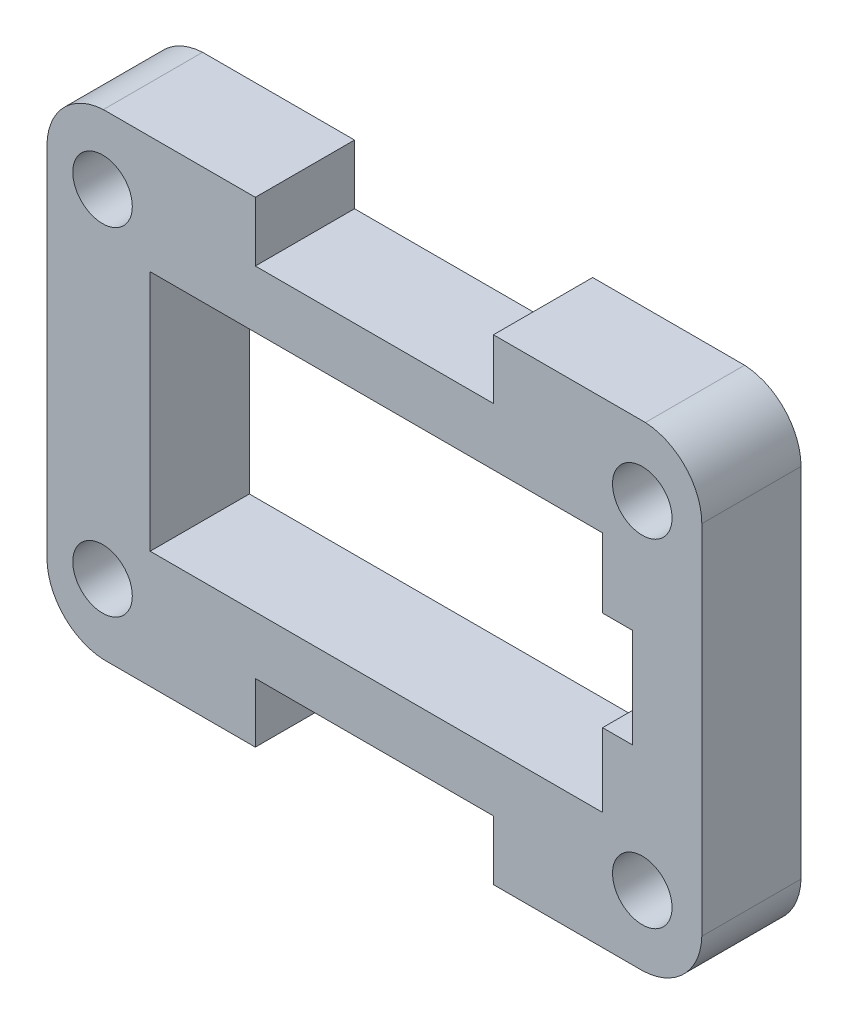
ISO-10303-21;
HEADER;
FILE_DESCRIPTION(('STEP AP214'),'2;1');
FILE_NAME('part.step','',(''),(''),'','','');
FILE_SCHEMA(('AUTOMOTIVE_DESIGN { 1 0 10303 214 1 1 1 1 }'));
ENDSEC;
DATA;
#1=APPLICATION_CONTEXT('core data for automotive mechanical design processes');
#2=APPLICATION_PROTOCOL_DEFINITION('international standard','automotive_design',2000,#1);
#3=PRODUCT_CONTEXT('',#1,'mechanical');
#4=PRODUCT('Part','Part','',(#3));
#5=PRODUCT_RELATED_PRODUCT_CATEGORY('part','',(#4));
#6=PRODUCT_DEFINITION_FORMATION('','',#4);
#7=PRODUCT_DEFINITION_CONTEXT('part definition',#1,'design');
#8=PRODUCT_DEFINITION('design','',#6,#7);
#9=PRODUCT_DEFINITION_SHAPE('','',#8);
#10=(LENGTH_UNIT() NAMED_UNIT(*) SI_UNIT(.MILLI.,.METRE.));
#11=(NAMED_UNIT(*) PLANE_ANGLE_UNIT() SI_UNIT($,.RADIAN.));
#12=(NAMED_UNIT(*) SI_UNIT($,.STERADIAN.) SOLID_ANGLE_UNIT());
#13=UNCERTAINTY_MEASURE_WITH_UNIT(LENGTH_MEASURE(1.E-05),#10,'distance_accuracy_value','');
#14=(GEOMETRIC_REPRESENTATION_CONTEXT(3) GLOBAL_UNCERTAINTY_ASSIGNED_CONTEXT((#13)) GLOBAL_UNIT_ASSIGNED_CONTEXT((#10,
#11,#12)) REPRESENTATION_CONTEXT('',''));
#15=CARTESIAN_POINT('',(0.,0.,0.));
#16=DIRECTION('',(0.,0.,1.));
#17=DIRECTION('',(1.,0.,0.));
#18=AXIS2_PLACEMENT_3D('',#15,#16,#17);
#19=CARTESIAN_POINT('',(2365.44028325265,1577.09064517226,5.));
#20=DIRECTION('',(0.,0.,1.));
#21=DIRECTION('',(1.,0.,0.));
#22=AXIS2_PLACEMENT_3D('',#19,#20,#21);
#23=PLANE('',#22);
#24=CARTESIAN_POINT('',(2338.24005814226,1559.58660497825,5.));
#25=DIRECTION('',(0.,0.,1.));
#26=DIRECTION('',(1.,0.,0.));
#27=AXIS2_PLACEMENT_3D('',#24,#25,#26);
#28=CIRCLE('',#27,1.50000000166674);
#29=CARTESIAN_POINT('',(2339.74005814393,1559.58660497825,5.));
#30=VERTEX_POINT('',#29);
#31=EDGE_CURVE('E802',#30,#30,#28,.T.);
#32=ORIENTED_EDGE('',*,*,#31,.F.);
#33=EDGE_LOOP('',(#32));
#34=FACE_BOUND('',#33,.T.);
#35=CARTESIAN_POINT('',(2365.44015813607,1576.58660498825,5.));
#36=DIRECTION('',(0.,0.,1.));
#37=DIRECTION('',(1.,0.,0.));
#38=AXIS2_PLACEMENT_3D('',#35,#36,#37);
#39=CIRCLE('',#38,1.50000000833429);
#40=CARTESIAN_POINT('',(2366.9401581444,1576.58660498825,5.));
#41=VERTEX_POINT('',#40);
#42=EDGE_CURVE('E249',#41,#41,#39,.T.);
#43=ORIENTED_EDGE('',*,*,#42,.F.);
#44=EDGE_LOOP('',(#43));
#45=FACE_BOUND('',#44,.T.);
#46=CARTESIAN_POINT('',(2365.44028325265,1577.09064517226,5.));
#47=DIRECTION('',(0.,0.,1.));
#48=DIRECTION('',(1.,0.,0.));
#49=AXIS2_PLACEMENT_3D('',#46,#47,#48);
#50=CIRCLE('',#49,2.99987488833167);
#51=CARTESIAN_POINT('',(2368.44015814071,1577.09060497992,5.));
#52=VERTEX_POINT('',#51);
#53=CARTESIAN_POINT('',(2365.59735814071,1580.08640497992,5.));
#54=VERTEX_POINT('',#53);
#55=EDGE_CURVE('E293',#52,#54,#50,.T.);
#56=ORIENTED_EDGE('',*,*,#55,.T.);
#57=DIRECTION('',(-1.,0.,0.));
#58=VECTOR('',#57,1.);
#59=CARTESIAN_POINT('',(2357.94015814059,1580.08640497992,5.));
#60=LINE('',#59,#58);
#61=CARTESIAN_POINT('',(2357.94015814059,1580.08640497992,5.));
#62=VERTEX_POINT('',#61);
#63=EDGE_CURVE('E297',#54,#62,#60,.T.);
#64=ORIENTED_EDGE('',*,*,#63,.T.);
#65=DIRECTION('',(0.,-1.,0.));
#66=VECTOR('',#65,1.);
#67=CARTESIAN_POINT('',(2357.94015814059,1577.08660497992,5.));
#68=LINE('',#67,#66);
#69=CARTESIAN_POINT('',(2357.94015814059,1577.08660497992,5.));
#70=VERTEX_POINT('',#69);
#71=EDGE_CURVE('E301',#62,#70,#68,.T.);
#72=ORIENTED_EDGE('',*,*,#71,.T.);
#73=DIRECTION('',(-1.,0.,0.));
#74=VECTOR('',#73,1.);
#75=CARTESIAN_POINT('',(2345.94015814059,1577.08660497992,5.));
#76=LINE('',#75,#74);
#77=CARTESIAN_POINT('',(2345.94015814059,1577.08660497992,5.));
#78=VERTEX_POINT('',#77);
#79=EDGE_CURVE('E304',#70,#78,#76,.T.);
#80=ORIENTED_EDGE('',*,*,#79,.T.);
#81=DIRECTION('',(0.,1.,0.));
#82=VECTOR('',#81,1.);
#83=CARTESIAN_POINT('',(2345.94015814059,1580.08640497992,5.));
#84=LINE('',#83,#82);
#85=CARTESIAN_POINT('',(2345.94015814059,1580.08640497992,5.));
#86=VERTEX_POINT('',#85);
#87=EDGE_CURVE('E307',#78,#86,#84,.T.);
#88=ORIENTED_EDGE('',*,*,#87,.T.);
#89=DIRECTION('',(-1.,1.15992584717666E-13,0.));
#90=VECTOR('',#89,1.);
#91=CARTESIAN_POINT('',(2338.28295814059,1580.08640497992,5.));
#92=LINE('',#91,#90);
#93=CARTESIAN_POINT('',(2338.28295814059,1580.08640497992,5.));
#94=VERTEX_POINT('',#93);
#95=EDGE_CURVE('E310',#86,#94,#92,.T.);
#96=ORIENTED_EDGE('',*,*,#95,.T.);
#97=CARTESIAN_POINT('',(2338.44003302866,1577.09064517226,5.));
#98=DIRECTION('',(0.,0.,1.));
#99=DIRECTION('',(1.,0.,0.));
#100=AXIS2_PLACEMENT_3D('',#97,#98,#99);
#101=CIRCLE('',#100,2.99987488833123);
#102=CARTESIAN_POINT('',(2335.4401581406,1577.09060497992,5.));
#103=VERTEX_POINT('',#102);
#104=EDGE_CURVE('E313',#94,#103,#101,.T.);
#105=ORIENTED_EDGE('',*,*,#104,.T.);
#106=DIRECTION('',(0.,-1.,0.));
#107=VECTOR('',#106,1.);
#108=CARTESIAN_POINT('',(2335.4401581406,1559.08240497992,5.));
#109=LINE('',#108,#107);
#110=CARTESIAN_POINT('',(2335.4401581406,1559.08240497992,5.));
#111=VERTEX_POINT('',#110);
#112=EDGE_CURVE('E316',#103,#111,#109,.T.);
#113=ORIENTED_EDGE('',*,*,#112,.T.);
#114=CARTESIAN_POINT('',(2338.44003302866,1559.08236478758,5.));
#115=DIRECTION('',(0.,0.,1.));
#116=DIRECTION('',(1.,0.,0.));
#117=AXIS2_PLACEMENT_3D('',#114,#115,#116);
#118=CIRCLE('',#117,2.99987488833177);
#119=CARTESIAN_POINT('',(2338.28295814059,1556.08660497992,5.));
#120=VERTEX_POINT('',#119);
#121=EDGE_CURVE('E319',#111,#120,#118,.T.);
#122=ORIENTED_EDGE('',*,*,#121,.T.);
#123=DIRECTION('',(1.,0.,0.));
#124=VECTOR('',#123,1.);
#125=CARTESIAN_POINT('',(2345.94015814059,1556.08660497992,5.));
#126=LINE('',#125,#124);
#127=CARTESIAN_POINT('',(2345.94015814059,1556.08660497992,5.));
#128=VERTEX_POINT('',#127);
#129=EDGE_CURVE('E322',#120,#128,#126,.T.);
#130=ORIENTED_EDGE('',*,*,#129,.T.);
#131=DIRECTION('',(0.,1.,0.));
#132=VECTOR('',#131,1.);
#133=CARTESIAN_POINT('',(2345.94015814059,1559.08660497992,5.));
#134=LINE('',#133,#132);
#135=CARTESIAN_POINT('',(2345.94015814059,1559.08660497992,5.));
#136=VERTEX_POINT('',#135);
#137=EDGE_CURVE('E325',#128,#136,#134,.T.);
#138=ORIENTED_EDGE('',*,*,#137,.T.);
#139=DIRECTION('',(1.,0.,0.));
#140=VECTOR('',#139,1.);
#141=CARTESIAN_POINT('',(2357.94015814059,1559.08660497992,5.));
#142=LINE('',#141,#140);
#143=CARTESIAN_POINT('',(2357.94015814059,1559.08660497992,5.));
#144=VERTEX_POINT('',#143);
#145=EDGE_CURVE('E328',#136,#144,#142,.T.);
#146=ORIENTED_EDGE('',*,*,#145,.T.);
#147=DIRECTION('',(0.,-1.,0.));
#148=VECTOR('',#147,1.);
#149=CARTESIAN_POINT('',(2357.94015814059,1556.08660497992,5.));
#150=LINE('',#149,#148);
#151=CARTESIAN_POINT('',(2357.94015814059,1556.08660497992,5.));
#152=VERTEX_POINT('',#151);
#153=EDGE_CURVE('E331',#144,#152,#150,.T.);
#154=ORIENTED_EDGE('',*,*,#153,.T.);
#155=DIRECTION('',(1.,0.,0.));
#156=VECTOR('',#155,1.);
#157=CARTESIAN_POINT('',(2365.44015814059,1556.08660497992,5.));
#158=LINE('',#157,#156);
#159=CARTESIAN_POINT('',(2365.44015814059,1556.08660497992,5.));
#160=VERTEX_POINT('',#159);
#161=EDGE_CURVE('E334',#152,#160,#158,.T.);
#162=ORIENTED_EDGE('',*,*,#161,.T.);
#163=CARTESIAN_POINT('',(2365.36168325253,1559.16519283098,5.));
#164=DIRECTION('',(0.,0.,1.));
#165=DIRECTION('',(1.,0.,0.));
#166=AXIS2_PLACEMENT_3D('',#163,#164,#165);
#167=CIRCLE('',#166,3.07958787254719);
#168=CARTESIAN_POINT('',(2368.44015814059,1559.08240497992,5.));
#169=VERTEX_POINT('',#168);
#170=EDGE_CURVE('E337',#160,#169,#167,.T.);
#171=ORIENTED_EDGE('',*,*,#170,.T.);
#172=DIRECTION('',(6.41170103403003E-12,1.,0.));
#173=VECTOR('',#172,1.);
#174=CARTESIAN_POINT('',(2368.44015814071,1577.09060497992,5.));
#175=LINE('',#174,#173);
#176=EDGE_CURVE('E340',#169,#52,#175,.T.);
#177=ORIENTED_EDGE('',*,*,#176,.T.);
#178=EDGE_LOOP('',(#56,#64,#72,#80,#88,#96,#105,#113,#122,#130,#138,#146,#154,#162,#171,#177));
#179=FACE_BOUND('',#178,.T.);
#180=DIRECTION('',(-1.,0.,0.));
#181=VECTOR('',#180,1.);
#182=CARTESIAN_POINT('',(2340.64015814059,1574.18860498835,5.));
#183=LINE('',#182,#181);
#184=CARTESIAN_POINT('',(2363.44015814059,1574.18860498835,5.));
#185=VERTEX_POINT('',#184);
#186=CARTESIAN_POINT('',(2340.64015814059,1574.18860498835,5.));
#187=VERTEX_POINT('',#186);
#188=EDGE_CURVE('E210',#185,#187,#183,.T.);
#189=ORIENTED_EDGE('',*,*,#188,.F.);
#190=DIRECTION('',(0.,1.,0.));
#191=VECTOR('',#190,1.);
#192=CARTESIAN_POINT('',(2363.44015814059,1574.18860498835,5.));
#193=LINE('',#192,#191);
#194=CARTESIAN_POINT('',(2363.44015814059,1570.68860498835,5.));
#195=VERTEX_POINT('',#194);
#196=EDGE_CURVE('E201',#195,#185,#193,.T.);
#197=ORIENTED_EDGE('',*,*,#196,.F.);
#198=DIRECTION('',(-1.,0.,0.));
#199=VECTOR('',#198,1.);
#200=CARTESIAN_POINT('',(2363.44015814059,1570.68860498835,5.));
#201=LINE('',#200,#199);
#202=CARTESIAN_POINT('',(2364.94015814059,1570.68860498835,5.));
#203=VERTEX_POINT('',#202);
#204=EDGE_CURVE('E244',#203,#195,#201,.T.);
#205=ORIENTED_EDGE('',*,*,#204,.F.);
#206=DIRECTION('',(0.,1.,0.));
#207=VECTOR('',#206,1.);
#208=CARTESIAN_POINT('',(2364.94015814059,1570.68860498835,5.));
#209=LINE('',#208,#207);
#210=CARTESIAN_POINT('',(2364.94015814059,1565.68860498835,5.));
#211=VERTEX_POINT('',#210);
#212=EDGE_CURVE('E241',#211,#203,#209,.T.);
#213=ORIENTED_EDGE('',*,*,#212,.F.);
#214=DIRECTION('',(1.,0.,0.));
#215=VECTOR('',#214,1.);
#216=CARTESIAN_POINT('',(2364.94015814059,1565.68860498835,5.));
#217=LINE('',#216,#215);
#218=CARTESIAN_POINT('',(2363.44015814059,1565.68860498835,5.));
#219=VERTEX_POINT('',#218);
#220=EDGE_CURVE('E238',#219,#211,#217,.T.);
#221=ORIENTED_EDGE('',*,*,#220,.F.);
#222=DIRECTION('',(0.,1.,0.));
#223=VECTOR('',#222,1.);
#224=CARTESIAN_POINT('',(2363.44015814059,1565.68860498835,5.));
#225=LINE('',#224,#223);
#226=CARTESIAN_POINT('',(2363.44015814059,1561.98860498835,5.));
#227=VERTEX_POINT('',#226);
#228=EDGE_CURVE('E235',#227,#219,#225,.T.);
#229=ORIENTED_EDGE('',*,*,#228,.F.);
#230=DIRECTION('',(1.,0.,0.));
#231=VECTOR('',#230,1.);
#232=CARTESIAN_POINT('',(2363.44015814059,1561.98860498835,5.));
#233=LINE('',#232,#231);
#234=CARTESIAN_POINT('',(2340.64015814059,1561.98860498835,5.));
#235=VERTEX_POINT('',#234);
#236=EDGE_CURVE('E229',#235,#227,#233,.T.);
#237=ORIENTED_EDGE('',*,*,#236,.F.);
#238=DIRECTION('',(0.,-1.,0.));
#239=VECTOR('',#238,1.);
#240=CARTESIAN_POINT('',(2340.64015814059,1561.98860498835,5.));
#241=LINE('',#240,#239);
#242=EDGE_CURVE('E225',#187,#235,#241,.T.);
#243=ORIENTED_EDGE('',*,*,#242,.F.);
#244=EDGE_LOOP('',(#189,#197,#205,#213,#221,#229,#237,#243));
#245=FACE_BOUND('',#244,.T.);
#246=CARTESIAN_POINT('',(2365.44010814393,1559.58655498325,5.));
#247=DIRECTION('',(0.,0.,1.));
#248=DIRECTION('',(1.,0.,0.));
#249=AXIS2_PLACEMENT_3D('',#246,#247,#248);
#250=CIRCLE('',#249,1.50000000000011);
#251=CARTESIAN_POINT('',(2366.94010814393,1559.58655498325,5.));
#252=VERTEX_POINT('',#251);
#253=EDGE_CURVE('E810',#252,#252,#250,.T.);
#254=ORIENTED_EDGE('',*,*,#253,.F.);
#255=EDGE_LOOP('',(#254));
#256=FACE_BOUND('',#255,.T.);
#257=CARTESIAN_POINT('',(2338.24010813393,1576.58665499325,5.));
#258=DIRECTION('',(0.,0.,1.));
#259=DIRECTION('',(1.,0.,0.));
#260=AXIS2_PLACEMENT_3D('',#257,#258,#259);
#261=CIRCLE('',#260,1.50000000000011);
#262=CARTESIAN_POINT('',(2339.74010813393,1576.58665499325,5.));
#263=VERTEX_POINT('',#262);
#264=EDGE_CURVE('E791',#263,#263,#261,.T.);
#265=ORIENTED_EDGE('',*,*,#264,.F.);
#266=EDGE_LOOP('',(#265));
#267=FACE_BOUND('',#266,.T.);
#268=ADVANCED_FACE('F39',(#34,#45,#179,#245,#256,#267),#23,.T.);
#269=CARTESIAN_POINT('',(2365.44028325265,1577.09064517226,0.));
#270=DIRECTION('',(0.,0.,1.));
#271=DIRECTION('',(1.,0.,0.));
#272=AXIS2_PLACEMENT_3D('',#269,#270,#271);
#273=PLANE('',#272);
#274=CARTESIAN_POINT('',(2365.44028325265,1577.09064517226,0.));
#275=DIRECTION('',(0.,0.,1.));
#276=DIRECTION('',(1.,0.,0.));
#277=AXIS2_PLACEMENT_3D('',#274,#275,#276);
#278=CIRCLE('',#277,2.99987488833167);
#279=CARTESIAN_POINT('',(2368.44015814071,1577.09060497992,0.));
#280=VERTEX_POINT('',#279);
#281=CARTESIAN_POINT('',(2365.59735814071,1580.08640497992,0.));
#282=VERTEX_POINT('',#281);
#283=EDGE_CURVE('E219',#280,#282,#278,.T.);
#284=ORIENTED_EDGE('',*,*,#283,.F.);
#285=DIRECTION('',(6.41170103403003E-12,1.,0.));
#286=VECTOR('',#285,1.);
#287=CARTESIAN_POINT('',(2368.44015814071,1577.09060497992,0.));
#288=LINE('',#287,#286);
#289=CARTESIAN_POINT('',(2368.44015814059,1559.08240497992,0.));
#290=VERTEX_POINT('',#289);
#291=EDGE_CURVE('E298',#290,#280,#288,.T.);
#292=ORIENTED_EDGE('',*,*,#291,.F.);
#293=CARTESIAN_POINT('',(2365.36168325253,1559.16519283098,0.));
#294=DIRECTION('',(0.,0.,1.));
#295=DIRECTION('',(1.,0.,0.));
#296=AXIS2_PLACEMENT_3D('',#293,#294,#295);
#297=CIRCLE('',#296,3.07958787254719);
#298=CARTESIAN_POINT('',(2365.44015814059,1556.08660497992,0.));
#299=VERTEX_POINT('',#298);
#300=EDGE_CURVE('E386',#299,#290,#297,.T.);
#301=ORIENTED_EDGE('',*,*,#300,.F.);
#302=DIRECTION('',(1.,0.,0.));
#303=VECTOR('',#302,1.);
#304=CARTESIAN_POINT('',(2365.44015814059,1556.08660497992,0.));
#305=LINE('',#304,#303);
#306=CARTESIAN_POINT('',(2357.94015814059,1556.08660497992,0.));
#307=VERTEX_POINT('',#306);
#308=EDGE_CURVE('E383',#307,#299,#305,.T.);
#309=ORIENTED_EDGE('',*,*,#308,.F.);
#310=DIRECTION('',(0.,-1.,0.));
#311=VECTOR('',#310,1.);
#312=CARTESIAN_POINT('',(2357.94015814059,1556.08660497992,0.));
#313=LINE('',#312,#311);
#314=CARTESIAN_POINT('',(2357.94015814059,1559.08660497992,0.));
#315=VERTEX_POINT('',#314);
#316=EDGE_CURVE('E380',#315,#307,#313,.T.);
#317=ORIENTED_EDGE('',*,*,#316,.F.);
#318=DIRECTION('',(1.,0.,0.));
#319=VECTOR('',#318,1.);
#320=CARTESIAN_POINT('',(2357.94015814059,1559.08660497992,0.));
#321=LINE('',#320,#319);
#322=CARTESIAN_POINT('',(2345.94015814059,1559.08660497992,0.));
#323=VERTEX_POINT('',#322);
#324=EDGE_CURVE('E377',#323,#315,#321,.T.);
#325=ORIENTED_EDGE('',*,*,#324,.F.);
#326=DIRECTION('',(0.,1.,0.));
#327=VECTOR('',#326,1.);
#328=CARTESIAN_POINT('',(2345.94015814059,1559.08660497992,0.));
#329=LINE('',#328,#327);
#330=CARTESIAN_POINT('',(2345.94015814059,1556.08660497992,0.));
#331=VERTEX_POINT('',#330);
#332=EDGE_CURVE('E374',#331,#323,#329,.T.);
#333=ORIENTED_EDGE('',*,*,#332,.F.);
#334=DIRECTION('',(1.,0.,0.));
#335=VECTOR('',#334,1.);
#336=CARTESIAN_POINT('',(2345.94015814059,1556.08660497992,0.));
#337=LINE('',#336,#335);
#338=CARTESIAN_POINT('',(2338.28295814059,1556.08660497992,0.));
#339=VERTEX_POINT('',#338);
#340=EDGE_CURVE('E371',#339,#331,#337,.T.);
#341=ORIENTED_EDGE('',*,*,#340,.F.);
#342=CARTESIAN_POINT('',(2338.44003302866,1559.08236478758,0.));
#343=DIRECTION('',(0.,0.,1.));
#344=DIRECTION('',(1.,0.,0.));
#345=AXIS2_PLACEMENT_3D('',#342,#343,#344);
#346=CIRCLE('',#345,2.99987488833177);
#347=CARTESIAN_POINT('',(2335.4401581406,1559.08240497992,0.));
#348=VERTEX_POINT('',#347);
#349=EDGE_CURVE('E368',#348,#339,#346,.T.);
#350=ORIENTED_EDGE('',*,*,#349,.F.);
#351=DIRECTION('',(0.,-1.,0.));
#352=VECTOR('',#351,1.);
#353=CARTESIAN_POINT('',(2335.4401581406,1559.08240497992,0.));
#354=LINE('',#353,#352);
#355=CARTESIAN_POINT('',(2335.4401581406,1577.09060497992,0.));
#356=VERTEX_POINT('',#355);
#357=EDGE_CURVE('E365',#356,#348,#354,.T.);
#358=ORIENTED_EDGE('',*,*,#357,.F.);
#359=CARTESIAN_POINT('',(2338.44003302866,1577.09064517226,0.));
#360=DIRECTION('',(0.,0.,1.));
#361=DIRECTION('',(1.,0.,0.));
#362=AXIS2_PLACEMENT_3D('',#359,#360,#361);
#363=CIRCLE('',#362,2.99987488833123);
#364=CARTESIAN_POINT('',(2338.28295814059,1580.08640497992,0.));
#365=VERTEX_POINT('',#364);
#366=EDGE_CURVE('E362',#365,#356,#363,.T.);
#367=ORIENTED_EDGE('',*,*,#366,.F.);
#368=DIRECTION('',(-1.,1.15992584717666E-13,0.));
#369=VECTOR('',#368,1.);
#370=CARTESIAN_POINT('',(2338.28295814059,1580.08640497992,0.));
#371=LINE('',#370,#369);
#372=CARTESIAN_POINT('',(2345.94015814059,1580.08640497992,0.));
#373=VERTEX_POINT('',#372);
#374=EDGE_CURVE('E359',#373,#365,#371,.T.);
#375=ORIENTED_EDGE('',*,*,#374,.F.);
#376=DIRECTION('',(0.,1.,0.));
#377=VECTOR('',#376,1.);
#378=CARTESIAN_POINT('',(2345.94015814059,1580.08640497992,0.));
#379=LINE('',#378,#377);
#380=CARTESIAN_POINT('',(2345.94015814059,1577.08660497992,0.));
#381=VERTEX_POINT('',#380);
#382=EDGE_CURVE('E356',#381,#373,#379,.T.);
#383=ORIENTED_EDGE('',*,*,#382,.F.);
#384=DIRECTION('',(-1.,0.,0.));
#385=VECTOR('',#384,1.);
#386=CARTESIAN_POINT('',(2345.94015814059,1577.08660497992,0.));
#387=LINE('',#386,#385);
#388=CARTESIAN_POINT('',(2357.94015814059,1577.08660497992,0.));
#389=VERTEX_POINT('',#388);
#390=EDGE_CURVE('E353',#389,#381,#387,.T.);
#391=ORIENTED_EDGE('',*,*,#390,.F.);
#392=DIRECTION('',(0.,-1.,0.));
#393=VECTOR('',#392,1.);
#394=CARTESIAN_POINT('',(2357.94015814059,1577.08660497992,0.));
#395=LINE('',#394,#393);
#396=CARTESIAN_POINT('',(2357.94015814059,1580.08640497992,0.));
#397=VERTEX_POINT('',#396);
#398=EDGE_CURVE('E350',#397,#389,#395,.T.);
#399=ORIENTED_EDGE('',*,*,#398,.F.);
#400=DIRECTION('',(-1.,0.,0.));
#401=VECTOR('',#400,1.);
#402=CARTESIAN_POINT('',(2357.94015814059,1580.08640497992,0.));
#403=LINE('',#402,#401);
#404=EDGE_CURVE('E347',#282,#397,#403,.T.);
#405=ORIENTED_EDGE('',*,*,#404,.F.);
#406=EDGE_LOOP('',(#284,#292,#301,#309,#317,#325,#333,#341,#350,#358,#367,#375,#383,#391,#399,#405));
#407=FACE_BOUND('',#406,.T.);
#408=DIRECTION('',(0.,1.,0.));
#409=VECTOR('',#408,1.);
#410=CARTESIAN_POINT('',(2363.44015814059,1574.18860498835,0.));
#411=LINE('',#410,#409);
#412=CARTESIAN_POINT('',(2363.44015814059,1570.68860498835,0.));
#413=VERTEX_POINT('',#412);
#414=CARTESIAN_POINT('',(2363.44015814059,1574.18860498835,0.));
#415=VERTEX_POINT('',#414);
#416=EDGE_CURVE('E63',#413,#415,#411,.T.);
#417=ORIENTED_EDGE('',*,*,#416,.T.);
#418=DIRECTION('',(-1.,0.,0.));
#419=VECTOR('',#418,1.);
#420=CARTESIAN_POINT('',(2340.64015814059,1574.18860498835,0.));
#421=LINE('',#420,#419);
#422=CARTESIAN_POINT('',(2340.64015814059,1574.18860498835,0.));
#423=VERTEX_POINT('',#422);
#424=EDGE_CURVE('E217',#415,#423,#421,.T.);
#425=ORIENTED_EDGE('',*,*,#424,.T.);
#426=DIRECTION('',(0.,-1.,0.));
#427=VECTOR('',#426,1.);
#428=CARTESIAN_POINT('',(2340.64015814059,1561.98860498835,0.));
#429=LINE('',#428,#427);
#430=CARTESIAN_POINT('',(2340.64015814059,1561.98860498835,0.));
#431=VERTEX_POINT('',#430);
#432=EDGE_CURVE('E252',#423,#431,#429,.T.);
#433=ORIENTED_EDGE('',*,*,#432,.T.);
#434=DIRECTION('',(1.,0.,0.));
#435=VECTOR('',#434,1.);
#436=CARTESIAN_POINT('',(2363.44015814059,1561.98860498835,0.));
#437=LINE('',#436,#435);
#438=CARTESIAN_POINT('',(2363.44015814059,1561.98860498835,0.));
#439=VERTEX_POINT('',#438);
#440=EDGE_CURVE('E256',#431,#439,#437,.T.);
#441=ORIENTED_EDGE('',*,*,#440,.T.);
#442=DIRECTION('',(0.,1.,0.));
#443=VECTOR('',#442,1.);
#444=CARTESIAN_POINT('',(2363.44015814059,1565.68860498835,0.));
#445=LINE('',#444,#443);
#446=CARTESIAN_POINT('',(2363.44015814059,1565.68860498835,0.));
#447=VERTEX_POINT('',#446);
#448=EDGE_CURVE('E260',#439,#447,#445,.T.);
#449=ORIENTED_EDGE('',*,*,#448,.T.);
#450=DIRECTION('',(1.,0.,0.));
#451=VECTOR('',#450,1.);
#452=CARTESIAN_POINT('',(2364.94015814059,1565.68860498835,0.));
#453=LINE('',#452,#451);
#454=CARTESIAN_POINT('',(2364.94015814059,1565.68860498835,0.));
#455=VERTEX_POINT('',#454);
#456=EDGE_CURVE('E264',#447,#455,#453,.T.);
#457=ORIENTED_EDGE('',*,*,#456,.T.);
#458=DIRECTION('',(0.,1.,0.));
#459=VECTOR('',#458,1.);
#460=CARTESIAN_POINT('',(2364.94015814059,1570.68860498835,0.));
#461=LINE('',#460,#459);
#462=CARTESIAN_POINT('',(2364.94015814059,1570.68860498835,0.));
#463=VERTEX_POINT('',#462);
#464=EDGE_CURVE('E268',#455,#463,#461,.T.);
#465=ORIENTED_EDGE('',*,*,#464,.T.);
#466=DIRECTION('',(-1.,0.,0.));
#467=VECTOR('',#466,1.);
#468=CARTESIAN_POINT('',(2363.44015814059,1570.68860498835,0.));
#469=LINE('',#468,#467);
#470=EDGE_CURVE('E211',#463,#413,#469,.T.);
#471=ORIENTED_EDGE('',*,*,#470,.T.);
#472=EDGE_LOOP('',(#417,#425,#433,#441,#449,#457,#465,#471));
#473=FACE_BOUND('',#472,.T.);
#474=CARTESIAN_POINT('',(2365.44015813607,1576.58660498825,0.));
#475=DIRECTION('',(0.,0.,1.));
#476=DIRECTION('',(1.,0.,0.));
#477=AXIS2_PLACEMENT_3D('',#474,#475,#476);
#478=CIRCLE('',#477,1.50000000833429);
#479=CARTESIAN_POINT('',(2366.9401581444,1576.58660498825,0.));
#480=VERTEX_POINT('',#479);
#481=EDGE_CURVE('E814',#480,#480,#478,.T.);
#482=ORIENTED_EDGE('',*,*,#481,.T.);
#483=EDGE_LOOP('',(#482));
#484=FACE_BOUND('',#483,.T.);
#485=CARTESIAN_POINT('',(2365.44010814393,1559.58655498325,0.));
#486=DIRECTION('',(0.,0.,1.));
#487=DIRECTION('',(1.,0.,0.));
#488=AXIS2_PLACEMENT_3D('',#485,#486,#487);
#489=CIRCLE('',#488,1.50000000000011);
#490=CARTESIAN_POINT('',(2366.94010814393,1559.58655498325,0.));
#491=VERTEX_POINT('',#490);
#492=EDGE_CURVE('E806',#491,#491,#489,.T.);
#493=ORIENTED_EDGE('',*,*,#492,.T.);
#494=EDGE_LOOP('',(#493));
#495=FACE_BOUND('',#494,.T.);
#496=CARTESIAN_POINT('',(2338.24005814226,1559.58660497825,0.));
#497=DIRECTION('',(0.,0.,1.));
#498=DIRECTION('',(1.,0.,0.));
#499=AXIS2_PLACEMENT_3D('',#496,#497,#498);
#500=CIRCLE('',#499,1.50000000166674);
#501=CARTESIAN_POINT('',(2339.74005814393,1559.58660497825,0.));
#502=VERTEX_POINT('',#501);
#503=EDGE_CURVE('E799',#502,#502,#500,.T.);
#504=ORIENTED_EDGE('',*,*,#503,.T.);
#505=EDGE_LOOP('',(#504));
#506=FACE_BOUND('',#505,.T.);
#507=CARTESIAN_POINT('',(2338.24010813393,1576.58665499325,0.));
#508=DIRECTION('',(0.,0.,1.));
#509=DIRECTION('',(1.,0.,0.));
#510=AXIS2_PLACEMENT_3D('',#507,#508,#509);
#511=CIRCLE('',#510,1.50000000000011);
#512=CARTESIAN_POINT('',(2339.74010813393,1576.58665499325,0.));
#513=VERTEX_POINT('',#512);
#514=EDGE_CURVE('E794',#513,#513,#511,.T.);
#515=ORIENTED_EDGE('',*,*,#514,.T.);
#516=EDGE_LOOP('',(#515));
#517=FACE_BOUND('',#516,.T.);
#518=ADVANCED_FACE('F457',(#407,#473,#484,#495,#506,#517),#273,.F.);
#519=CARTESIAN_POINT('',(2365.44028325265,1577.09064517226,5.));
#520=DIRECTION('',(0.,0.,-1.));
#521=DIRECTION('',(-1.,0.,0.));
#522=AXIS2_PLACEMENT_3D('',#519,#520,#521);
#523=CYLINDRICAL_SURFACE('',#522,2.99987488833167);
#524=ORIENTED_EDGE('',*,*,#283,.T.);
#525=DIRECTION('',(0.,0.,-1.));
#526=VECTOR('',#525,1.);
#527=CARTESIAN_POINT('',(2365.59735814071,1580.08640497992,5.));
#528=LINE('',#527,#526);
#529=EDGE_CURVE('E11',#54,#282,#528,.T.);
#530=ORIENTED_EDGE('',*,*,#529,.F.);
#531=ORIENTED_EDGE('',*,*,#55,.F.);
#532=DIRECTION('',(0.,0.,-1.));
#533=VECTOR('',#532,1.);
#534=CARTESIAN_POINT('',(2368.44015814071,1577.09060497992,5.));
#535=LINE('',#534,#533);
#536=EDGE_CURVE('E343',#52,#280,#535,.T.);
#537=ORIENTED_EDGE('',*,*,#536,.T.);
#538=EDGE_LOOP('',(#524,#530,#531,#537));
#539=FACE_BOUND('',#538,.T.);
#540=ADVANCED_FACE('F41',(#539),#523,.T.);
#541=CARTESIAN_POINT('',(2357.94015814059,1580.08640497992,5.));
#542=DIRECTION('',(0.,-1.,0.));
#543=DIRECTION('',(1.,0.,0.));
#544=AXIS2_PLACEMENT_3D('',#541,#542,#543);
#545=PLANE('',#544);
#546=ORIENTED_EDGE('',*,*,#404,.T.);
#547=DIRECTION('',(0.,0.,-1.));
#548=VECTOR('',#547,1.);
#549=CARTESIAN_POINT('',(2357.94015814059,1580.08640497992,5.));
#550=LINE('',#549,#548);
#551=EDGE_CURVE('E48',#62,#397,#550,.T.);
#552=ORIENTED_EDGE('',*,*,#551,.F.);
#553=ORIENTED_EDGE('',*,*,#63,.F.);
#554=ORIENTED_EDGE('',*,*,#529,.T.);
#555=EDGE_LOOP('',(#546,#552,#553,#554));
#556=FACE_BOUND('',#555,.T.);
#557=ADVANCED_FACE('F474',(#556),#545,.F.);
#558=CARTESIAN_POINT('',(2357.94015814059,1577.08660497992,5.));
#559=DIRECTION('',(1.,0.,0.));
#560=DIRECTION('',(0.,0.,-1.));
#561=AXIS2_PLACEMENT_3D('',#558,#559,#560);
#562=PLANE('',#561);
#563=ORIENTED_EDGE('',*,*,#398,.T.);
#564=DIRECTION('',(0.,0.,-1.));
#565=VECTOR('',#564,1.);
#566=CARTESIAN_POINT('',(2357.94015814059,1577.08660497992,5.));
#567=LINE('',#566,#565);
#568=EDGE_CURVE('E442',#70,#389,#567,.T.);
#569=ORIENTED_EDGE('',*,*,#568,.F.);
#570=ORIENTED_EDGE('',*,*,#71,.F.);
#571=ORIENTED_EDGE('',*,*,#551,.T.);
#572=EDGE_LOOP('',(#563,#569,#570,#571));
#573=FACE_BOUND('',#572,.T.);
#574=ADVANCED_FACE('F451',(#573),#562,.F.);
#575=CARTESIAN_POINT('',(2345.94015814059,1577.08660497992,5.));
#576=DIRECTION('',(0.,-1.,0.));
#577=DIRECTION('',(0.,0.,-1.));
#578=AXIS2_PLACEMENT_3D('',#575,#576,#577);
#579=PLANE('',#578);
#580=ORIENTED_EDGE('',*,*,#390,.T.);
#581=DIRECTION('',(0.,0.,-1.));
#582=VECTOR('',#581,1.);
#583=CARTESIAN_POINT('',(2345.94015814059,1577.08660497992,5.));
#584=LINE('',#583,#582);
#585=EDGE_CURVE('E438',#78,#381,#584,.T.);
#586=ORIENTED_EDGE('',*,*,#585,.F.);
#587=ORIENTED_EDGE('',*,*,#79,.F.);
#588=ORIENTED_EDGE('',*,*,#568,.T.);
#589=EDGE_LOOP('',(#580,#586,#587,#588));
#590=FACE_BOUND('',#589,.T.);
#591=ADVANCED_FACE('F463',(#590),#579,.F.);
#592=CARTESIAN_POINT('',(2345.94015814059,1580.08640497992,5.));
#593=DIRECTION('',(-1.,0.,0.));
#594=DIRECTION('',(0.,0.,1.));
#595=AXIS2_PLACEMENT_3D('',#592,#593,#594);
#596=PLANE('',#595);
#597=ORIENTED_EDGE('',*,*,#382,.T.);
#598=DIRECTION('',(0.,0.,-1.));
#599=VECTOR('',#598,1.);
#600=CARTESIAN_POINT('',(2345.94015814059,1580.08640497992,5.));
#601=LINE('',#600,#599);
#602=EDGE_CURVE('E434',#86,#373,#601,.T.);
#603=ORIENTED_EDGE('',*,*,#602,.F.);
#604=ORIENTED_EDGE('',*,*,#87,.F.);
#605=ORIENTED_EDGE('',*,*,#585,.T.);
#606=EDGE_LOOP('',(#597,#603,#604,#605));
#607=FACE_BOUND('',#606,.T.);
#608=ADVANCED_FACE('F467',(#607),#596,.F.);
#609=CARTESIAN_POINT('',(2338.28295814059,1580.08640497992,5.));
#610=DIRECTION('',(-1.15992584717666E-13,-1.,0.));
#611=DIRECTION('',(1.,-1.15992584717666E-13,0.));
#612=AXIS2_PLACEMENT_3D('',#609,#610,#611);
#613=PLANE('',#612);
#614=ORIENTED_EDGE('',*,*,#374,.T.);
#615=DIRECTION('',(0.,0.,-1.));
#616=VECTOR('',#615,1.);
#617=CARTESIAN_POINT('',(2338.28295814059,1580.08640497992,5.));
#618=LINE('',#617,#616);
#619=EDGE_CURVE('E430',#94,#365,#618,.T.);
#620=ORIENTED_EDGE('',*,*,#619,.F.);
#621=ORIENTED_EDGE('',*,*,#95,.F.);
#622=ORIENTED_EDGE('',*,*,#602,.T.);
#623=EDGE_LOOP('',(#614,#620,#621,#622));
#624=FACE_BOUND('',#623,.T.);
#625=ADVANCED_FACE('F527',(#624),#613,.F.);
#626=CARTESIAN_POINT('',(2338.44003302866,1577.09064517226,5.));
#627=DIRECTION('',(0.,0.,-1.));
#628=DIRECTION('',(-1.,0.,0.));
#629=AXIS2_PLACEMENT_3D('',#626,#627,#628);
#630=CYLINDRICAL_SURFACE('',#629,2.99987488833123);
#631=ORIENTED_EDGE('',*,*,#366,.T.);
#632=DIRECTION('',(0.,0.,-1.));
#633=VECTOR('',#632,1.);
#634=CARTESIAN_POINT('',(2335.4401581406,1577.09060497992,5.));
#635=LINE('',#634,#633);
#636=EDGE_CURVE('E426',#103,#356,#635,.T.);
#637=ORIENTED_EDGE('',*,*,#636,.F.);
#638=ORIENTED_EDGE('',*,*,#104,.F.);
#639=ORIENTED_EDGE('',*,*,#619,.T.);
#640=EDGE_LOOP('',(#631,#637,#638,#639));
#641=FACE_BOUND('',#640,.T.);
#642=ADVANCED_FACE('F524',(#641),#630,.T.);
#643=CARTESIAN_POINT('',(2335.4401581406,1559.08240497992,5.));
#644=DIRECTION('',(1.,0.,0.));
#645=DIRECTION('',(0.,0.,-1.));
#646=AXIS2_PLACEMENT_3D('',#643,#644,#645);
#647=PLANE('',#646);
#648=ORIENTED_EDGE('',*,*,#357,.T.);
#649=DIRECTION('',(0.,0.,-1.));
#650=VECTOR('',#649,1.);
#651=CARTESIAN_POINT('',(2335.4401581406,1559.08240497992,5.));
#652=LINE('',#651,#650);
#653=EDGE_CURVE('E422',#111,#348,#652,.T.);
#654=ORIENTED_EDGE('',*,*,#653,.F.);
#655=ORIENTED_EDGE('',*,*,#112,.F.);
#656=ORIENTED_EDGE('',*,*,#636,.T.);
#657=EDGE_LOOP('',(#648,#654,#655,#656));
#658=FACE_BOUND('',#657,.T.);
#659=ADVANCED_FACE('F520',(#658),#647,.F.);
#660=CARTESIAN_POINT('',(2338.44003302866,1559.08236478758,5.));
#661=DIRECTION('',(0.,0.,-1.));
#662=DIRECTION('',(-1.,0.,0.));
#663=AXIS2_PLACEMENT_3D('',#660,#661,#662);
#664=CYLINDRICAL_SURFACE('',#663,2.99987488833177);
#665=ORIENTED_EDGE('',*,*,#349,.T.);
#666=DIRECTION('',(0.,0.,-1.));
#667=VECTOR('',#666,1.);
#668=CARTESIAN_POINT('',(2338.28295814059,1556.08660497992,5.));
#669=LINE('',#668,#667);
#670=EDGE_CURVE('E418',#120,#339,#669,.T.);
#671=ORIENTED_EDGE('',*,*,#670,.F.);
#672=ORIENTED_EDGE('',*,*,#121,.F.);
#673=ORIENTED_EDGE('',*,*,#653,.T.);
#674=EDGE_LOOP('',(#665,#671,#672,#673));
#675=FACE_BOUND('',#674,.T.);
#676=ADVANCED_FACE('F516',(#675),#664,.T.);
#677=CARTESIAN_POINT('',(2345.94015814059,1556.08660497992,5.));
#678=DIRECTION('',(0.,1.,0.));
#679=DIRECTION('',(0.,0.,1.));
#680=AXIS2_PLACEMENT_3D('',#677,#678,#679);
#681=PLANE('',#680);
#682=ORIENTED_EDGE('',*,*,#340,.T.);
#683=DIRECTION('',(0.,0.,-1.));
#684=VECTOR('',#683,1.);
#685=CARTESIAN_POINT('',(2345.94015814059,1556.08660497992,5.));
#686=LINE('',#685,#684);
#687=EDGE_CURVE('E414',#128,#331,#686,.T.);
#688=ORIENTED_EDGE('',*,*,#687,.F.);
#689=ORIENTED_EDGE('',*,*,#129,.F.);
#690=ORIENTED_EDGE('',*,*,#670,.T.);
#691=EDGE_LOOP('',(#682,#688,#689,#690));
#692=FACE_BOUND('',#691,.T.);
#693=ADVANCED_FACE('F511',(#692),#681,.F.);
#694=CARTESIAN_POINT('',(2345.94015814059,1559.08660497992,5.));
#695=DIRECTION('',(-1.,0.,0.));
#696=DIRECTION('',(0.,0.,1.));
#697=AXIS2_PLACEMENT_3D('',#694,#695,#696);
#698=PLANE('',#697);
#699=ORIENTED_EDGE('',*,*,#332,.T.);
#700=DIRECTION('',(0.,0.,-1.));
#701=VECTOR('',#700,1.);
#702=CARTESIAN_POINT('',(2345.94015814059,1559.08660497992,5.));
#703=LINE('',#702,#701);
#704=EDGE_CURVE('E410',#136,#323,#703,.T.);
#705=ORIENTED_EDGE('',*,*,#704,.F.);
#706=ORIENTED_EDGE('',*,*,#137,.F.);
#707=ORIENTED_EDGE('',*,*,#687,.T.);
#708=EDGE_LOOP('',(#699,#705,#706,#707));
#709=FACE_BOUND('',#708,.T.);
#710=ADVANCED_FACE('F505',(#709),#698,.F.);
#711=CARTESIAN_POINT('',(2357.94015814059,1559.08660497992,5.));
#712=DIRECTION('',(0.,1.,0.));
#713=DIRECTION('',(0.,0.,1.));
#714=AXIS2_PLACEMENT_3D('',#711,#712,#713);
#715=PLANE('',#714);
#716=ORIENTED_EDGE('',*,*,#324,.T.);
#717=DIRECTION('',(0.,0.,-1.));
#718=VECTOR('',#717,1.);
#719=CARTESIAN_POINT('',(2357.94015814059,1559.08660497992,5.));
#720=LINE('',#719,#718);
#721=EDGE_CURVE('E406',#144,#315,#720,.T.);
#722=ORIENTED_EDGE('',*,*,#721,.F.);
#723=ORIENTED_EDGE('',*,*,#145,.F.);
#724=ORIENTED_EDGE('',*,*,#704,.T.);
#725=EDGE_LOOP('',(#716,#722,#723,#724));
#726=FACE_BOUND('',#725,.T.);
#727=ADVANCED_FACE('F501',(#726),#715,.F.);
#728=CARTESIAN_POINT('',(2357.94015814059,1556.08660497992,5.));
#729=DIRECTION('',(1.,0.,0.));
#730=DIRECTION('',(0.,0.,-1.));
#731=AXIS2_PLACEMENT_3D('',#728,#729,#730);
#732=PLANE('',#731);
#733=ORIENTED_EDGE('',*,*,#316,.T.);
#734=DIRECTION('',(0.,0.,-1.));
#735=VECTOR('',#734,1.);
#736=CARTESIAN_POINT('',(2357.94015814059,1556.08660497992,5.));
#737=LINE('',#736,#735);
#738=EDGE_CURVE('E402',#152,#307,#737,.T.);
#739=ORIENTED_EDGE('',*,*,#738,.F.);
#740=ORIENTED_EDGE('',*,*,#153,.F.);
#741=ORIENTED_EDGE('',*,*,#721,.T.);
#742=EDGE_LOOP('',(#733,#739,#740,#741));
#743=FACE_BOUND('',#742,.T.);
#744=ADVANCED_FACE('F496',(#743),#732,.F.);
#745=CARTESIAN_POINT('',(2365.44015814059,1556.08660497992,5.));
#746=DIRECTION('',(0.,1.,0.));
#747=DIRECTION('',(0.,0.,1.));
#748=AXIS2_PLACEMENT_3D('',#745,#746,#747);
#749=PLANE('',#748);
#750=ORIENTED_EDGE('',*,*,#308,.T.);
#751=DIRECTION('',(0.,0.,-1.));
#752=VECTOR('',#751,1.);
#753=CARTESIAN_POINT('',(2365.44015814059,1556.08660497992,5.));
#754=LINE('',#753,#752);
#755=EDGE_CURVE('E398',#160,#299,#754,.T.);
#756=ORIENTED_EDGE('',*,*,#755,.F.);
#757=ORIENTED_EDGE('',*,*,#161,.F.);
#758=ORIENTED_EDGE('',*,*,#738,.T.);
#759=EDGE_LOOP('',(#750,#756,#757,#758));
#760=FACE_BOUND('',#759,.T.);
#761=ADVANCED_FACE('F490',(#760),#749,.F.);
#762=CARTESIAN_POINT('',(2365.36168325253,1559.16519283098,5.));
#763=DIRECTION('',(0.,0.,-1.));
#764=DIRECTION('',(-1.,0.,0.));
#765=AXIS2_PLACEMENT_3D('',#762,#763,#764);
#766=CYLINDRICAL_SURFACE('',#765,3.07958787254719);
#767=ORIENTED_EDGE('',*,*,#300,.T.);
#768=DIRECTION('',(0.,0.,-1.));
#769=VECTOR('',#768,1.);
#770=CARTESIAN_POINT('',(2368.44015814059,1559.08240497992,5.));
#771=LINE('',#770,#769);
#772=EDGE_CURVE('E394',#169,#290,#771,.T.);
#773=ORIENTED_EDGE('',*,*,#772,.F.);
#774=ORIENTED_EDGE('',*,*,#170,.F.);
#775=ORIENTED_EDGE('',*,*,#755,.T.);
#776=EDGE_LOOP('',(#767,#773,#774,#775));
#777=FACE_BOUND('',#776,.T.);
#778=ADVANCED_FACE('F486',(#777),#766,.T.);
#779=CARTESIAN_POINT('',(2368.44015814071,1577.09060497992,5.));
#780=DIRECTION('',(-1.,6.41170103403003E-12,0.));
#781=DIRECTION('',(-6.41170103403003E-12,-1.,0.));
#782=AXIS2_PLACEMENT_3D('',#779,#780,#781);
#783=PLANE('',#782);
#784=ORIENTED_EDGE('',*,*,#291,.T.);
#785=ORIENTED_EDGE('',*,*,#536,.F.);
#786=ORIENTED_EDGE('',*,*,#176,.F.);
#787=ORIENTED_EDGE('',*,*,#772,.T.);
#788=EDGE_LOOP('',(#784,#785,#786,#787));
#789=FACE_BOUND('',#788,.T.);
#790=ADVANCED_FACE('F481',(#789),#783,.F.);
#791=CARTESIAN_POINT('',(2363.44015814059,1574.18860498835,5.));
#792=DIRECTION('',(-1.,0.,0.));
#793=DIRECTION('',(0.,0.,1.));
#794=AXIS2_PLACEMENT_3D('',#791,#792,#793);
#795=PLANE('',#794);
#796=ORIENTED_EDGE('',*,*,#416,.F.);
#797=DIRECTION('',(0.,0.,-1.));
#798=VECTOR('',#797,1.);
#799=CARTESIAN_POINT('',(2363.44015814059,1570.68860498835,5.));
#800=LINE('',#799,#798);
#801=EDGE_CURVE('E205',#195,#413,#800,.T.);
#802=ORIENTED_EDGE('',*,*,#801,.F.);
#803=ORIENTED_EDGE('',*,*,#196,.T.);
#804=DIRECTION('',(0.,0.,-1.));
#805=VECTOR('',#804,1.);
#806=CARTESIAN_POINT('',(2363.44015814059,1574.18860498835,5.));
#807=LINE('',#806,#805);
#808=EDGE_CURVE('E204',#185,#415,#807,.T.);
#809=ORIENTED_EDGE('',*,*,#808,.T.);
#810=EDGE_LOOP('',(#796,#802,#803,#809));
#811=FACE_BOUND('',#810,.T.);
#812=ADVANCED_FACE('F203',(#811),#795,.T.);
#813=CARTESIAN_POINT('',(2340.64015814059,1574.18860498835,5.));
#814=DIRECTION('',(0.,-1.,0.));
#815=DIRECTION('',(0.,0.,-1.));
#816=AXIS2_PLACEMENT_3D('',#813,#814,#815);
#817=PLANE('',#816);
#818=ORIENTED_EDGE('',*,*,#424,.F.);
#819=ORIENTED_EDGE('',*,*,#808,.F.);
#820=ORIENTED_EDGE('',*,*,#188,.T.);
#821=DIRECTION('',(0.,0.,-1.));
#822=VECTOR('',#821,1.);
#823=CARTESIAN_POINT('',(2340.64015814059,1574.18860498835,5.));
#824=LINE('',#823,#822);
#825=EDGE_CURVE('E220',#187,#423,#824,.T.);
#826=ORIENTED_EDGE('',*,*,#825,.T.);
#827=EDGE_LOOP('',(#818,#819,#820,#826));
#828=FACE_BOUND('',#827,.T.);
#829=ADVANCED_FACE('F214',(#828),#817,.T.);
#830=CARTESIAN_POINT('',(2340.64015814059,1561.98860498835,5.));
#831=DIRECTION('',(1.,0.,0.));
#832=DIRECTION('',(0.,0.,-1.));
#833=AXIS2_PLACEMENT_3D('',#830,#831,#832);
#834=PLANE('',#833);
#835=ORIENTED_EDGE('',*,*,#432,.F.);
#836=ORIENTED_EDGE('',*,*,#825,.F.);
#837=ORIENTED_EDGE('',*,*,#242,.T.);
#838=DIRECTION('',(0.,0.,-1.));
#839=VECTOR('',#838,1.);
#840=CARTESIAN_POINT('',(2340.64015814059,1561.98860498835,5.));
#841=LINE('',#840,#839);
#842=EDGE_CURVE('E288',#235,#431,#841,.T.);
#843=ORIENTED_EDGE('',*,*,#842,.T.);
#844=EDGE_LOOP('',(#835,#836,#837,#843));
#845=FACE_BOUND('',#844,.T.);
#846=ADVANCED_FACE('F612',(#845),#834,.T.);
#847=CARTESIAN_POINT('',(2363.44015814059,1561.98860498835,5.));
#848=DIRECTION('',(0.,1.,0.));
#849=DIRECTION('',(0.,0.,1.));
#850=AXIS2_PLACEMENT_3D('',#847,#848,#849);
#851=PLANE('',#850);
#852=ORIENTED_EDGE('',*,*,#440,.F.);
#853=ORIENTED_EDGE('',*,*,#842,.F.);
#854=ORIENTED_EDGE('',*,*,#236,.T.);
#855=DIRECTION('',(0.,0.,-1.));
#856=VECTOR('',#855,1.);
#857=CARTESIAN_POINT('',(2363.44015814059,1561.98860498835,5.));
#858=LINE('',#857,#856);
#859=EDGE_CURVE('E285',#227,#439,#858,.T.);
#860=ORIENTED_EDGE('',*,*,#859,.T.);
#861=EDGE_LOOP('',(#852,#853,#854,#860));
#862=FACE_BOUND('',#861,.T.);
#863=ADVANCED_FACE('F618',(#862),#851,.T.);
#864=CARTESIAN_POINT('',(2363.44015814059,1565.68860498835,5.));
#865=DIRECTION('',(-1.,0.,0.));
#866=DIRECTION('',(0.,0.,1.));
#867=AXIS2_PLACEMENT_3D('',#864,#865,#866);
#868=PLANE('',#867);
#869=ORIENTED_EDGE('',*,*,#448,.F.);
#870=ORIENTED_EDGE('',*,*,#859,.F.);
#871=ORIENTED_EDGE('',*,*,#228,.T.);
#872=DIRECTION('',(0.,0.,-1.));
#873=VECTOR('',#872,1.);
#874=CARTESIAN_POINT('',(2363.44015814059,1565.68860498835,5.));
#875=LINE('',#874,#873);
#876=EDGE_CURVE('E282',#219,#447,#875,.T.);
#877=ORIENTED_EDGE('',*,*,#876,.T.);
#878=EDGE_LOOP('',(#869,#870,#871,#877));
#879=FACE_BOUND('',#878,.T.);
#880=ADVANCED_FACE('F626',(#879),#868,.T.);
#881=CARTESIAN_POINT('',(2364.94015814059,1565.68860498835,5.));
#882=DIRECTION('',(0.,1.,0.));
#883=DIRECTION('',(0.,0.,1.));
#884=AXIS2_PLACEMENT_3D('',#881,#882,#883);
#885=PLANE('',#884);
#886=ORIENTED_EDGE('',*,*,#456,.F.);
#887=ORIENTED_EDGE('',*,*,#876,.F.);
#888=ORIENTED_EDGE('',*,*,#220,.T.);
#889=DIRECTION('',(0.,0.,-1.));
#890=VECTOR('',#889,1.);
#891=CARTESIAN_POINT('',(2364.94015814059,1565.68860498835,5.));
#892=LINE('',#891,#890);
#893=EDGE_CURVE('E279',#211,#455,#892,.T.);
#894=ORIENTED_EDGE('',*,*,#893,.T.);
#895=EDGE_LOOP('',(#886,#887,#888,#894));
#896=FACE_BOUND('',#895,.T.);
#897=ADVANCED_FACE('F634',(#896),#885,.T.);
#898=CARTESIAN_POINT('',(2364.94015814059,1570.68860498835,5.));
#899=DIRECTION('',(-1.,0.,0.));
#900=DIRECTION('',(0.,0.,1.));
#901=AXIS2_PLACEMENT_3D('',#898,#899,#900);
#902=PLANE('',#901);
#903=ORIENTED_EDGE('',*,*,#464,.F.);
#904=ORIENTED_EDGE('',*,*,#893,.F.);
#905=ORIENTED_EDGE('',*,*,#212,.T.);
#906=DIRECTION('',(0.,0.,-1.));
#907=VECTOR('',#906,1.);
#908=CARTESIAN_POINT('',(2364.94015814059,1570.68860498835,5.));
#909=LINE('',#908,#907);
#910=EDGE_CURVE('E55',#203,#463,#909,.T.);
#911=ORIENTED_EDGE('',*,*,#910,.T.);
#912=EDGE_LOOP('',(#903,#904,#905,#911));
#913=FACE_BOUND('',#912,.T.);
#914=ADVANCED_FACE('F642',(#913),#902,.T.);
#915=CARTESIAN_POINT('',(2363.44015814059,1570.68860498835,5.));
#916=DIRECTION('',(0.,-1.,0.));
#917=DIRECTION('',(0.,0.,-1.));
#918=AXIS2_PLACEMENT_3D('',#915,#916,#917);
#919=PLANE('',#918);
#920=ORIENTED_EDGE('',*,*,#470,.F.);
#921=ORIENTED_EDGE('',*,*,#910,.F.);
#922=ORIENTED_EDGE('',*,*,#204,.T.);
#923=ORIENTED_EDGE('',*,*,#801,.T.);
#924=EDGE_LOOP('',(#920,#921,#922,#923));
#925=FACE_BOUND('',#924,.T.);
#926=ADVANCED_FACE('F650',(#925),#919,.T.);
#927=CARTESIAN_POINT('',(2365.44015813607,1576.58660498825,5.));
#928=DIRECTION('',(0.,0.,-1.));
#929=DIRECTION('',(-1.,0.,0.));
#930=AXIS2_PLACEMENT_3D('',#927,#928,#929);
#931=CYLINDRICAL_SURFACE('',#930,1.50000000833429);
#932=ORIENTED_EDGE('',*,*,#42,.T.);
#933=EDGE_LOOP('',(#932));
#934=FACE_BOUND('',#933,.T.);
#935=ORIENTED_EDGE('',*,*,#481,.F.);
#936=EDGE_LOOP('',(#935));
#937=FACE_BOUND('',#936,.T.);
#938=ADVANCED_FACE('F658',(#934,#937),#931,.F.);
#939=CARTESIAN_POINT('',(2365.44010814393,1559.58655498325,5.));
#940=DIRECTION('',(0.,0.,-1.));
#941=DIRECTION('',(-1.,0.,0.));
#942=AXIS2_PLACEMENT_3D('',#939,#940,#941);
#943=CYLINDRICAL_SURFACE('',#942,1.50000000000011);
#944=ORIENTED_EDGE('',*,*,#253,.T.);
#945=EDGE_LOOP('',(#944));
#946=FACE_BOUND('',#945,.T.);
#947=ORIENTED_EDGE('',*,*,#492,.F.);
#948=EDGE_LOOP('',(#947));
#949=FACE_BOUND('',#948,.T.);
#950=ADVANCED_FACE('F665',(#946,#949),#943,.F.);
#951=CARTESIAN_POINT('',(2338.24005814226,1559.58660497825,5.));
#952=DIRECTION('',(0.,0.,-1.));
#953=DIRECTION('',(-1.,0.,0.));
#954=AXIS2_PLACEMENT_3D('',#951,#952,#953);
#955=CYLINDRICAL_SURFACE('',#954,1.50000000166674);
#956=ORIENTED_EDGE('',*,*,#31,.T.);
#957=EDGE_LOOP('',(#956));
#958=FACE_BOUND('',#957,.T.);
#959=ORIENTED_EDGE('',*,*,#503,.F.);
#960=EDGE_LOOP('',(#959));
#961=FACE_BOUND('',#960,.T.);
#962=ADVANCED_FACE('F673',(#958,#961),#955,.F.);
#963=CARTESIAN_POINT('',(2338.24010813393,1576.58665499325,5.));
#964=DIRECTION('',(0.,0.,-1.));
#965=DIRECTION('',(-1.,0.,0.));
#966=AXIS2_PLACEMENT_3D('',#963,#964,#965);
#967=CYLINDRICAL_SURFACE('',#966,1.50000000000011);
#968=ORIENTED_EDGE('',*,*,#264,.T.);
#969=EDGE_LOOP('',(#968));
#970=FACE_BOUND('',#969,.T.);
#971=ORIENTED_EDGE('',*,*,#514,.F.);
#972=EDGE_LOOP('',(#971));
#973=FACE_BOUND('',#972,.T.);
#974=ADVANCED_FACE('F681',(#970,#973),#967,.F.);
#975=CLOSED_SHELL('',(#268,#518,#540,#557,#574,#591,#608,#625,#642,#659,#676,#693,#710,#727,
#744,#761,#778,#790,#812,#829,#846,#863,#880,#897,#914,#926,#938,#950,#962,#974));
#976=MANIFOLD_SOLID_BREP('B2',#975);
#977=ADVANCED_BREP_SHAPE_REPRESENTATION('',(#18,#976),#14);
#978=SHAPE_DEFINITION_REPRESENTATION(#9,#977);
ENDSEC;
END-ISO-10303-21;
